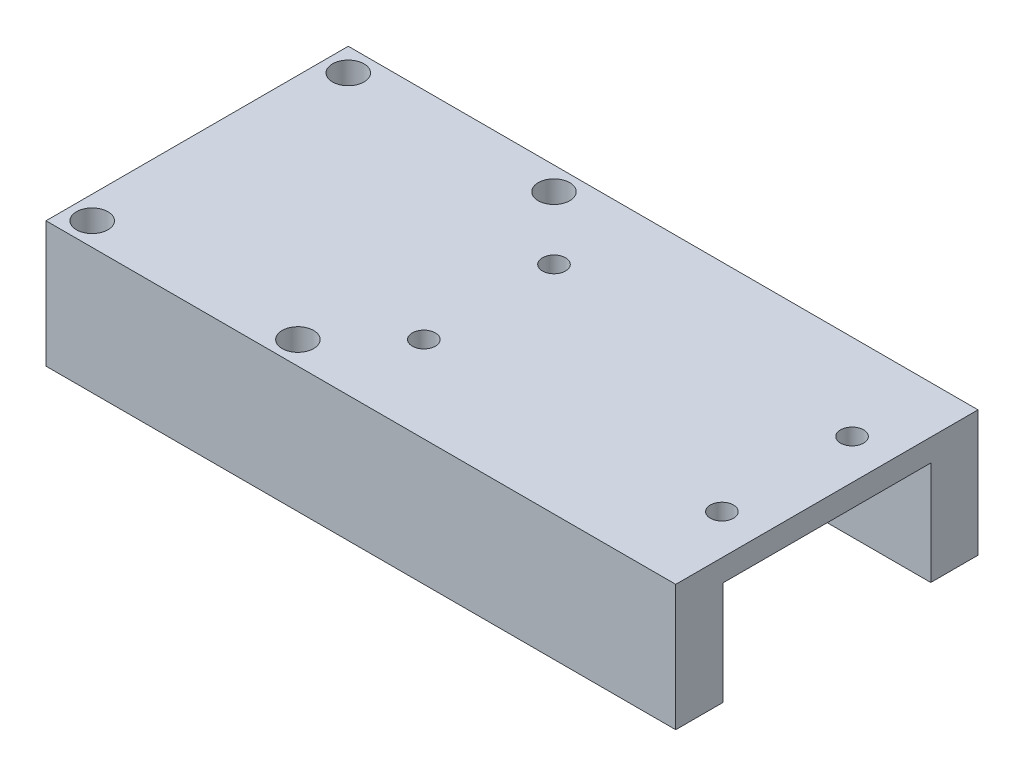
ISO-10303-21;
HEADER;
FILE_DESCRIPTION(('STEP AP214'),'2;1');
FILE_NAME('part.step','',(''),(''),'','','');
FILE_SCHEMA(('AUTOMOTIVE_DESIGN { 1 0 10303 214 1 1 1 1 }'));
ENDSEC;
DATA;
#1=APPLICATION_CONTEXT('core data for automotive mechanical design processes');
#2=APPLICATION_PROTOCOL_DEFINITION('international standard','automotive_design',2000,#1);
#3=PRODUCT_CONTEXT('',#1,'mechanical');
#4=PRODUCT('Part','Part','',(#3));
#5=PRODUCT_RELATED_PRODUCT_CATEGORY('part','',(#4));
#6=PRODUCT_DEFINITION_FORMATION('','',#4);
#7=PRODUCT_DEFINITION_CONTEXT('part definition',#1,'design');
#8=PRODUCT_DEFINITION('design','',#6,#7);
#9=PRODUCT_DEFINITION_SHAPE('','',#8);
#10=(LENGTH_UNIT() NAMED_UNIT(*) SI_UNIT(.MILLI.,.METRE.));
#11=(NAMED_UNIT(*) PLANE_ANGLE_UNIT() SI_UNIT($,.RADIAN.));
#12=(NAMED_UNIT(*) SI_UNIT($,.STERADIAN.) SOLID_ANGLE_UNIT());
#13=UNCERTAINTY_MEASURE_WITH_UNIT(LENGTH_MEASURE(1.E-05),#10,'distance_accuracy_value','');
#14=(GEOMETRIC_REPRESENTATION_CONTEXT(3) GLOBAL_UNCERTAINTY_ASSIGNED_CONTEXT((#13)) GLOBAL_UNIT_ASSIGNED_CONTEXT((#10,
#11,#12)) REPRESENTATION_CONTEXT('',''));
#15=CARTESIAN_POINT('',(0.,0.,0.));
#16=DIRECTION('',(0.,0.,1.));
#17=DIRECTION('',(1.,0.,0.));
#18=AXIS2_PLACEMENT_3D('',#15,#16,#17);
#19=CARTESIAN_POINT('',(15.,30.,18.));
#20=DIRECTION('',(-1.,0.,0.));
#21=DIRECTION('',(0.,0.,1.));
#22=AXIS2_PLACEMENT_3D('',#19,#20,#21);
#23=PLANE('',#22);
#24=DIRECTION('',(0.,-1.,0.));
#25=VECTOR('',#24,1.);
#26=CARTESIAN_POINT('',(15.,27.3313976045781,-12.375));
#27=LINE('',#26,#25);
#28=CARTESIAN_POINT('',(15.,27.3313976045781,-12.375));
#29=VERTEX_POINT('',#28);
#30=CARTESIAN_POINT('',(15.,15.,-12.375));
#31=VERTEX_POINT('',#30);
#32=EDGE_CURVE('E64',#29,#31,#27,.T.);
#33=ORIENTED_EDGE('',*,*,#32,.F.);
#34=DIRECTION('',(0.,0.,-1.));
#35=VECTOR('',#34,1.);
#36=CARTESIAN_POINT('',(15.,27.3313976045781,12.375));
#37=LINE('',#36,#35);
#38=CARTESIAN_POINT('',(15.,27.3313976045781,-1.03791045750838));
#39=VERTEX_POINT('',#38);
#40=EDGE_CURVE('E11',#39,#29,#37,.T.);
#41=ORIENTED_EDGE('',*,*,#40,.F.);
#42=CARTESIAN_POINT('',(15.,15.,0.));
#43=DIRECTION('',(1.,0.,0.));
#44=DIRECTION('',(0.,0.,-1.));
#45=AXIS2_PLACEMENT_3D('',#42,#43,#44);
#46=CIRCLE('',#45,12.375);
#47=EDGE_CURVE('E241',#31,#39,#46,.T.);
#48=ORIENTED_EDGE('',*,*,#47,.F.);
#49=EDGE_LOOP('',(#33,#41,#48));
#50=FACE_BOUND('',#49,.T.);
#51=ADVANCED_FACE('F45',(#50),#23,.F.);
#52=CARTESIAN_POINT('',(15.,27.3313976045781,12.375));
#53=VERTEX_POINT('',#52);
#54=CARTESIAN_POINT('',(15.,27.3313976045781,1.03791045750838));
#55=VERTEX_POINT('',#54);
#56=EDGE_CURVE('E56',#53,#55,#37,.T.);
#57=ORIENTED_EDGE('',*,*,#56,.F.);
#58=DIRECTION('',(0.,1.,0.));
#59=VECTOR('',#58,1.);
#60=CARTESIAN_POINT('',(15.,15.,12.375));
#61=LINE('',#60,#59);
#62=CARTESIAN_POINT('',(15.,15.,12.375));
#63=VERTEX_POINT('',#62);
#64=EDGE_CURVE('E178',#63,#53,#61,.T.);
#65=ORIENTED_EDGE('',*,*,#64,.F.);
#66=EDGE_CURVE('E71',#55,#63,#46,.T.);
#67=ORIENTED_EDGE('',*,*,#66,.F.);
#68=EDGE_LOOP('',(#57,#65,#67));
#69=FACE_BOUND('',#68,.T.);
#70=ADVANCED_FACE('F300',(#69),#23,.F.);
#71=CARTESIAN_POINT('',(-15.,30.,-18.));
#72=DIRECTION('',(0.,0.,1.));
#73=DIRECTION('',(1.,0.,0.));
#74=AXIS2_PLACEMENT_3D('',#71,#72,#73);
#75=PLANE('',#74);
#76=DIRECTION('',(-1.,0.,0.));
#77=VECTOR('',#76,1.);
#78=CARTESIAN_POINT('',(-15.,30.,-18.));
#79=LINE('',#78,#77);
#80=CARTESIAN_POINT('',(60.,30.,-18.));
#81=VERTEX_POINT('',#80);
#82=CARTESIAN_POINT('',(-15.,30.,-18.));
#83=VERTEX_POINT('',#82);
#84=EDGE_CURVE('E247',#81,#83,#79,.T.);
#85=ORIENTED_EDGE('',*,*,#84,.F.);
#86=DIRECTION('',(0.,1.,0.));
#87=VECTOR('',#86,1.);
#88=CARTESIAN_POINT('',(60.,27.3313976045781,-18.));
#89=LINE('',#88,#87);
#90=CARTESIAN_POINT('',(60.,15.,-18.));
#91=VERTEX_POINT('',#90);
#92=EDGE_CURVE('E172',#91,#81,#89,.T.);
#93=ORIENTED_EDGE('',*,*,#92,.F.);
#94=DIRECTION('',(1.,0.,0.));
#95=VECTOR('',#94,1.);
#96=CARTESIAN_POINT('',(-15.,15.,-18.));
#97=LINE('',#96,#95);
#98=CARTESIAN_POINT('',(-15.,15.,-18.));
#99=VERTEX_POINT('',#98);
#100=EDGE_CURVE('E137',#99,#91,#97,.T.);
#101=ORIENTED_EDGE('',*,*,#100,.F.);
#102=DIRECTION('',(0.,-1.,0.));
#103=VECTOR('',#102,1.);
#104=CARTESIAN_POINT('',(-15.,30.,-18.));
#105=LINE('',#104,#103);
#106=EDGE_CURVE('E54',#83,#99,#105,.T.);
#107=ORIENTED_EDGE('',*,*,#106,.F.);
#108=EDGE_LOOP('',(#85,#93,#101,#107));
#109=FACE_BOUND('',#108,.T.);
#110=ADVANCED_FACE('F305',(#109),#75,.F.);
#111=CARTESIAN_POINT('',(-15.,30.,18.));
#112=DIRECTION('',(1.,0.,0.));
#113=DIRECTION('',(0.,0.,-1.));
#114=AXIS2_PLACEMENT_3D('',#111,#112,#113);
#115=PLANE('',#114);
#116=ORIENTED_EDGE('',*,*,#106,.T.);
#117=DIRECTION('',(0.,0.,1.));
#118=VECTOR('',#117,1.);
#119=CARTESIAN_POINT('',(-15.,15.,18.));
#120=LINE('',#119,#118);
#121=CARTESIAN_POINT('',(-15.,15.,-12.375));
#122=VERTEX_POINT('',#121);
#123=EDGE_CURVE('E138',#99,#122,#120,.T.);
#124=ORIENTED_EDGE('',*,*,#123,.T.);
#125=CARTESIAN_POINT('',(-15.,15.,0.));
#126=DIRECTION('',(1.,0.,0.));
#127=DIRECTION('',(0.,0.,-1.));
#128=AXIS2_PLACEMENT_3D('',#125,#126,#127);
#129=CIRCLE('',#128,12.375);
#130=CARTESIAN_POINT('',(-15.,15.,12.375));
#131=VERTEX_POINT('',#130);
#132=EDGE_CURVE('E245',#122,#131,#129,.T.);
#133=ORIENTED_EDGE('',*,*,#132,.T.);
#134=CARTESIAN_POINT('',(-15.,15.,18.));
#135=VERTEX_POINT('',#134);
#136=EDGE_CURVE('E199',#131,#135,#120,.T.);
#137=ORIENTED_EDGE('',*,*,#136,.T.);
#138=DIRECTION('',(0.,-1.,0.));
#139=VECTOR('',#138,1.);
#140=CARTESIAN_POINT('',(-15.,30.,18.));
#141=LINE('',#140,#139);
#142=CARTESIAN_POINT('',(-15.,30.,18.));
#143=VERTEX_POINT('',#142);
#144=EDGE_CURVE('E132',#143,#135,#141,.T.);
#145=ORIENTED_EDGE('',*,*,#144,.F.);
#146=DIRECTION('',(0.,0.,1.));
#147=VECTOR('',#146,1.);
#148=CARTESIAN_POINT('',(-15.,30.,18.));
#149=LINE('',#148,#147);
#150=EDGE_CURVE('E250',#83,#143,#149,.T.);
#151=ORIENTED_EDGE('',*,*,#150,.F.);
#152=EDGE_LOOP('',(#116,#124,#133,#137,#145,#151));
#153=FACE_BOUND('',#152,.T.);
#154=ADVANCED_FACE('F309',(#153),#115,.F.);
#155=CARTESIAN_POINT('',(-15.,30.,18.));
#156=DIRECTION('',(0.,0.,-1.));
#157=DIRECTION('',(-1.,0.,0.));
#158=AXIS2_PLACEMENT_3D('',#155,#156,#157);
#159=PLANE('',#158);
#160=ORIENTED_EDGE('',*,*,#144,.T.);
#161=DIRECTION('',(1.,0.,0.));
#162=VECTOR('',#161,1.);
#163=CARTESIAN_POINT('',(-15.,15.,18.));
#164=LINE('',#163,#162);
#165=CARTESIAN_POINT('',(60.,15.,18.));
#166=VERTEX_POINT('',#165);
#167=EDGE_CURVE('E126',#135,#166,#164,.T.);
#168=ORIENTED_EDGE('',*,*,#167,.T.);
#169=DIRECTION('',(0.,-1.,0.));
#170=VECTOR('',#169,1.);
#171=CARTESIAN_POINT('',(60.,30.,18.));
#172=LINE('',#171,#170);
#173=CARTESIAN_POINT('',(60.,30.,18.));
#174=VERTEX_POINT('',#173);
#175=EDGE_CURVE('E130',#174,#166,#172,.T.);
#176=ORIENTED_EDGE('',*,*,#175,.F.);
#177=DIRECTION('',(1.,0.,0.));
#178=VECTOR('',#177,1.);
#179=CARTESIAN_POINT('',(-15.,30.,18.));
#180=LINE('',#179,#178);
#181=EDGE_CURVE('E253',#143,#174,#180,.T.);
#182=ORIENTED_EDGE('',*,*,#181,.F.);
#183=EDGE_LOOP('',(#160,#168,#176,#182));
#184=FACE_BOUND('',#183,.T.);
#185=ADVANCED_FACE('F128',(#184),#159,.F.);
#186=CARTESIAN_POINT('',(0.,30.,0.));
#187=DIRECTION('',(0.,-1.,0.));
#188=DIRECTION('',(0.,0.,-1.));
#189=AXIS2_PLACEMENT_3D('',#186,#187,#188);
#190=PLANE('',#189);
#191=CARTESIAN_POINT('',(55.25,30.,-7.74999999999999));
#192=DIRECTION('',(0.,1.,0.));
#193=DIRECTION('',(0.,0.,-1.));
#194=AXIS2_PLACEMENT_3D('',#191,#192,#193);
#195=CIRCLE('',#194,1.375);
#196=CARTESIAN_POINT('',(55.25,30.,-9.12499999999999));
#197=VERTEX_POINT('',#196);
#198=EDGE_CURVE('E542',#197,#197,#195,.T.);
#199=ORIENTED_EDGE('',*,*,#198,.F.);
#200=EDGE_LOOP('',(#199));
#201=FACE_BOUND('',#200,.T.);
#202=CARTESIAN_POINT('',(55.25,30.,7.74999999999999));
#203=DIRECTION('',(0.,1.,0.));
#204=DIRECTION('',(0.,0.,1.));
#205=AXIS2_PLACEMENT_3D('',#202,#203,#204);
#206=CIRCLE('',#205,1.375);
#207=CARTESIAN_POINT('',(55.25,30.,9.125));
#208=VERTEX_POINT('',#207);
#209=EDGE_CURVE('E536',#208,#208,#206,.T.);
#210=ORIENTED_EDGE('',*,*,#209,.F.);
#211=EDGE_LOOP('',(#210));
#212=FACE_BOUND('',#211,.T.);
#213=CARTESIAN_POINT('',(19.75,30.,7.75));
#214=DIRECTION('',(0.,1.,0.));
#215=DIRECTION('',(0.,0.,-1.));
#216=AXIS2_PLACEMENT_3D('',#213,#214,#215);
#217=CIRCLE('',#216,1.375);
#218=CARTESIAN_POINT('',(19.75,30.,6.375));
#219=VERTEX_POINT('',#218);
#220=EDGE_CURVE('E519',#219,#219,#217,.T.);
#221=ORIENTED_EDGE('',*,*,#220,.F.);
#222=EDGE_LOOP('',(#221));
#223=FACE_BOUND('',#222,.T.);
#224=CARTESIAN_POINT('',(19.75,30.,-7.75));
#225=DIRECTION('',(0.,1.,0.));
#226=DIRECTION('',(0.,0.,1.));
#227=AXIS2_PLACEMENT_3D('',#224,#225,#226);
#228=CIRCLE('',#227,1.375);
#229=CARTESIAN_POINT('',(19.75,30.,-6.375));
#230=VERTEX_POINT('',#229);
#231=EDGE_CURVE('E272',#230,#230,#228,.T.);
#232=ORIENTED_EDGE('',*,*,#231,.F.);
#233=EDGE_LOOP('',(#232));
#234=FACE_BOUND('',#233,.T.);
#235=CARTESIAN_POINT('',(12.25,30.,-15.25));
#236=DIRECTION('',(0.,1.,0.));
#237=DIRECTION('',(0.,0.,-1.));
#238=AXIS2_PLACEMENT_3D('',#235,#236,#237);
#239=CIRCLE('',#238,1.875);
#240=CARTESIAN_POINT('',(12.25,30.,-17.125));
#241=VERTEX_POINT('',#240);
#242=EDGE_CURVE('E225',#241,#241,#239,.T.);
#243=ORIENTED_EDGE('',*,*,#242,.F.);
#244=EDGE_LOOP('',(#243));
#245=FACE_BOUND('',#244,.T.);
#246=CARTESIAN_POINT('',(12.25,30.,15.25));
#247=DIRECTION('',(0.,1.,0.));
#248=DIRECTION('',(0.,0.,1.));
#249=AXIS2_PLACEMENT_3D('',#246,#247,#248);
#250=CIRCLE('',#249,1.875);
#251=CARTESIAN_POINT('',(12.25,30.,17.125));
#252=VERTEX_POINT('',#251);
#253=EDGE_CURVE('E231',#252,#252,#250,.T.);
#254=ORIENTED_EDGE('',*,*,#253,.F.);
#255=EDGE_LOOP('',(#254));
#256=FACE_BOUND('',#255,.T.);
#257=CARTESIAN_POINT('',(-12.25,30.,15.25));
#258=DIRECTION('',(0.,1.,0.));
#259=DIRECTION('',(0.,0.,-1.));
#260=AXIS2_PLACEMENT_3D('',#257,#258,#259);
#261=CIRCLE('',#260,1.875);
#262=CARTESIAN_POINT('',(-12.25,30.,13.375));
#263=VERTEX_POINT('',#262);
#264=EDGE_CURVE('E226',#263,#263,#261,.T.);
#265=ORIENTED_EDGE('',*,*,#264,.F.);
#266=EDGE_LOOP('',(#265));
#267=FACE_BOUND('',#266,.T.);
#268=CARTESIAN_POINT('',(-12.25,30.,-15.25));
#269=DIRECTION('',(0.,1.,0.));
#270=DIRECTION('',(0.,0.,1.));
#271=AXIS2_PLACEMENT_3D('',#268,#269,#270);
#272=CIRCLE('',#271,1.875);
#273=CARTESIAN_POINT('',(-12.25,30.,-13.375));
#274=VERTEX_POINT('',#273);
#275=EDGE_CURVE('E230',#274,#274,#272,.T.);
#276=ORIENTED_EDGE('',*,*,#275,.F.);
#277=EDGE_LOOP('',(#276));
#278=FACE_BOUND('',#277,.T.);
#279=ORIENTED_EDGE('',*,*,#181,.T.);
#280=DIRECTION('',(0.,0.,1.));
#281=VECTOR('',#280,1.);
#282=CARTESIAN_POINT('',(60.,30.,18.));
#283=LINE('',#282,#281);
#284=EDGE_CURVE('E147',#81,#174,#283,.T.);
#285=ORIENTED_EDGE('',*,*,#284,.F.);
#286=ORIENTED_EDGE('',*,*,#84,.T.);
#287=ORIENTED_EDGE('',*,*,#150,.T.);
#288=EDGE_LOOP('',(#279,#285,#286,#287));
#289=FACE_BOUND('',#288,.T.);
#290=ADVANCED_FACE('F332',(#201,#212,#223,#234,#245,#256,#267,#278,#289),#190,.F.);
#291=CARTESIAN_POINT('',(-25.,15.,0.));
#292=DIRECTION('',(1.,0.,0.));
#293=DIRECTION('',(0.,0.,-1.));
#294=AXIS2_PLACEMENT_3D('',#291,#292,#293);
#295=CYLINDRICAL_SURFACE('',#294,12.375);
#296=ORIENTED_EDGE('',*,*,#47,.T.);
#297=EDGE_CURVE('E246',#39,#55,#46,.T.);
#298=ORIENTED_EDGE('',*,*,#297,.T.);
#299=ORIENTED_EDGE('',*,*,#66,.T.);
#300=DIRECTION('',(1.,0.,0.));
#301=VECTOR('',#300,1.);
#302=CARTESIAN_POINT('',(-25.,15.,12.375));
#303=LINE('',#302,#301);
#304=EDGE_CURVE('E221',#63,#131,#303,.F.);
#305=ORIENTED_EDGE('',*,*,#304,.T.);
#306=ORIENTED_EDGE('',*,*,#132,.F.);
#307=DIRECTION('',(1.,0.,0.));
#308=VECTOR('',#307,1.);
#309=CARTESIAN_POINT('',(-25.,15.,-12.375));
#310=LINE('',#309,#308);
#311=EDGE_CURVE('E218',#122,#31,#310,.T.);
#312=ORIENTED_EDGE('',*,*,#311,.T.);
#313=EDGE_LOOP('',(#296,#298,#299,#305,#306,#312));
#314=FACE_BOUND('',#313,.T.);
#315=ADVANCED_FACE('F334',(#314),#295,.F.);
#316=CARTESIAN_POINT('',(-12.25,-10.,-15.25));
#317=DIRECTION('',(0.,1.,0.));
#318=DIRECTION('',(0.,0.,1.));
#319=AXIS2_PLACEMENT_3D('',#316,#317,#318);
#320=CYLINDRICAL_SURFACE('',#319,1.875);
#321=CARTESIAN_POINT('',(-12.25,15.,-15.25));
#322=DIRECTION('',(0.,1.,0.));
#323=DIRECTION('',(0.,0.,1.));
#324=AXIS2_PLACEMENT_3D('',#321,#322,#323);
#325=CIRCLE('',#324,1.875);
#326=CARTESIAN_POINT('',(-12.25,15.,-13.375));
#327=VERTEX_POINT('',#326);
#328=EDGE_CURVE('E214',#327,#327,#325,.F.);
#329=ORIENTED_EDGE('',*,*,#328,.T.);
#330=EDGE_LOOP('',(#329));
#331=FACE_BOUND('',#330,.T.);
#332=ORIENTED_EDGE('',*,*,#275,.T.);
#333=EDGE_LOOP('',(#332));
#334=FACE_BOUND('',#333,.T.);
#335=ADVANCED_FACE('F342',(#331,#334),#320,.F.);
#336=CARTESIAN_POINT('',(-12.25,-10.,15.25));
#337=DIRECTION('',(0.,1.,0.));
#338=DIRECTION('',(0.,0.,1.));
#339=AXIS2_PLACEMENT_3D('',#336,#337,#338);
#340=CYLINDRICAL_SURFACE('',#339,1.875);
#341=CARTESIAN_POINT('',(-12.25,15.,15.25));
#342=DIRECTION('',(0.,1.,0.));
#343=DIRECTION('',(0.,0.,1.));
#344=AXIS2_PLACEMENT_3D('',#341,#342,#343);
#345=CIRCLE('',#344,1.875);
#346=CARTESIAN_POINT('',(-12.25,15.,17.125));
#347=VERTEX_POINT('',#346);
#348=EDGE_CURVE('E210',#347,#347,#345,.F.);
#349=ORIENTED_EDGE('',*,*,#348,.T.);
#350=EDGE_LOOP('',(#349));
#351=FACE_BOUND('',#350,.T.);
#352=ORIENTED_EDGE('',*,*,#264,.T.);
#353=EDGE_LOOP('',(#352));
#354=FACE_BOUND('',#353,.T.);
#355=ADVANCED_FACE('F363',(#351,#354),#340,.F.);
#356=CARTESIAN_POINT('',(12.25,-10.,15.25));
#357=DIRECTION('',(0.,1.,0.));
#358=DIRECTION('',(0.,0.,1.));
#359=AXIS2_PLACEMENT_3D('',#356,#357,#358);
#360=CYLINDRICAL_SURFACE('',#359,1.875);
#361=CARTESIAN_POINT('',(12.25,15.,15.25));
#362=DIRECTION('',(0.,1.,0.));
#363=DIRECTION('',(0.,0.,1.));
#364=AXIS2_PLACEMENT_3D('',#361,#362,#363);
#365=CIRCLE('',#364,1.875);
#366=CARTESIAN_POINT('',(12.25,15.,17.125));
#367=VERTEX_POINT('',#366);
#368=EDGE_CURVE('E206',#367,#367,#365,.F.);
#369=ORIENTED_EDGE('',*,*,#368,.T.);
#370=EDGE_LOOP('',(#369));
#371=FACE_BOUND('',#370,.T.);
#372=ORIENTED_EDGE('',*,*,#253,.T.);
#373=EDGE_LOOP('',(#372));
#374=FACE_BOUND('',#373,.T.);
#375=ADVANCED_FACE('F372',(#371,#374),#360,.F.);
#376=CARTESIAN_POINT('',(12.25,-10.,-15.25));
#377=DIRECTION('',(0.,1.,0.));
#378=DIRECTION('',(0.,0.,1.));
#379=AXIS2_PLACEMENT_3D('',#376,#377,#378);
#380=CYLINDRICAL_SURFACE('',#379,1.875);
#381=CARTESIAN_POINT('',(12.25,15.,-15.25));
#382=DIRECTION('',(0.,1.,0.));
#383=DIRECTION('',(0.,0.,1.));
#384=AXIS2_PLACEMENT_3D('',#381,#382,#383);
#385=CIRCLE('',#384,1.875);
#386=CARTESIAN_POINT('',(12.25,15.,-13.375));
#387=VERTEX_POINT('',#386);
#388=EDGE_CURVE('E204',#387,#387,#385,.F.);
#389=ORIENTED_EDGE('',*,*,#388,.T.);
#390=EDGE_LOOP('',(#389));
#391=FACE_BOUND('',#390,.T.);
#392=ORIENTED_EDGE('',*,*,#242,.T.);
#393=EDGE_LOOP('',(#392));
#394=FACE_BOUND('',#393,.T.);
#395=ADVANCED_FACE('F380',(#391,#394),#380,.F.);
#396=CARTESIAN_POINT('',(-15.,15.,18.));
#397=DIRECTION('',(0.,1.,0.));
#398=DIRECTION('',(0.,0.,1.));
#399=AXIS2_PLACEMENT_3D('',#396,#397,#398);
#400=PLANE('',#399);
#401=ORIENTED_EDGE('',*,*,#328,.F.);
#402=EDGE_LOOP('',(#401));
#403=FACE_BOUND('',#402,.T.);
#404=ORIENTED_EDGE('',*,*,#388,.F.);
#405=EDGE_LOOP('',(#404));
#406=FACE_BOUND('',#405,.T.);
#407=ORIENTED_EDGE('',*,*,#123,.F.);
#408=ORIENTED_EDGE('',*,*,#100,.T.);
#409=DIRECTION('',(0.,0.,-1.));
#410=VECTOR('',#409,1.);
#411=CARTESIAN_POINT('',(60.,15.,-18.));
#412=LINE('',#411,#410);
#413=CARTESIAN_POINT('',(60.,15.,-12.375));
#414=VERTEX_POINT('',#413);
#415=EDGE_CURVE('E168',#414,#91,#412,.T.);
#416=ORIENTED_EDGE('',*,*,#415,.F.);
#417=DIRECTION('',(-1.,0.,0.));
#418=VECTOR('',#417,1.);
#419=CARTESIAN_POINT('',(60.,15.,-12.375));
#420=LINE('',#419,#418);
#421=EDGE_CURVE('E177',#414,#31,#420,.T.);
#422=ORIENTED_EDGE('',*,*,#421,.T.);
#423=ORIENTED_EDGE('',*,*,#311,.F.);
#424=EDGE_LOOP('',(#407,#408,#416,#422,#423));
#425=FACE_BOUND('',#424,.T.);
#426=ADVANCED_FACE('F325',(#403,#406,#425),#400,.F.);
#427=ORIENTED_EDGE('',*,*,#348,.F.);
#428=EDGE_LOOP('',(#427));
#429=FACE_BOUND('',#428,.T.);
#430=ORIENTED_EDGE('',*,*,#368,.F.);
#431=EDGE_LOOP('',(#430));
#432=FACE_BOUND('',#431,.T.);
#433=ORIENTED_EDGE('',*,*,#304,.F.);
#434=DIRECTION('',(-1.,0.,0.));
#435=VECTOR('',#434,1.);
#436=CARTESIAN_POINT('',(60.,15.,12.375));
#437=LINE('',#436,#435);
#438=CARTESIAN_POINT('',(60.,15.,12.375));
#439=VERTEX_POINT('',#438);
#440=EDGE_CURVE('E153',#439,#63,#437,.T.);
#441=ORIENTED_EDGE('',*,*,#440,.F.);
#442=DIRECTION('',(0.,0.,-1.));
#443=VECTOR('',#442,1.);
#444=CARTESIAN_POINT('',(60.,15.,18.));
#445=LINE('',#444,#443);
#446=EDGE_CURVE('E143',#166,#439,#445,.T.);
#447=ORIENTED_EDGE('',*,*,#446,.F.);
#448=ORIENTED_EDGE('',*,*,#167,.F.);
#449=ORIENTED_EDGE('',*,*,#136,.F.);
#450=EDGE_LOOP('',(#433,#441,#447,#448,#449));
#451=FACE_BOUND('',#450,.T.);
#452=ADVANCED_FACE('F151',(#429,#432,#451),#400,.F.);
#453=CARTESIAN_POINT('',(60.,15.,12.375));
#454=DIRECTION('',(0.,0.,1.));
#455=DIRECTION('',(1.,0.,0.));
#456=AXIS2_PLACEMENT_3D('',#453,#454,#455);
#457=PLANE('',#456);
#458=ORIENTED_EDGE('',*,*,#64,.T.);
#459=DIRECTION('',(-1.,0.,0.));
#460=VECTOR('',#459,1.);
#461=CARTESIAN_POINT('',(60.,27.3313976045781,12.375));
#462=LINE('',#461,#460);
#463=CARTESIAN_POINT('',(60.,27.3313976045781,12.375));
#464=VERTEX_POINT('',#463);
#465=EDGE_CURVE('E193',#464,#53,#462,.T.);
#466=ORIENTED_EDGE('',*,*,#465,.F.);
#467=DIRECTION('',(0.,1.,0.));
#468=VECTOR('',#467,1.);
#469=CARTESIAN_POINT('',(60.,15.,12.375));
#470=LINE('',#469,#468);
#471=EDGE_CURVE('E156',#439,#464,#470,.T.);
#472=ORIENTED_EDGE('',*,*,#471,.F.);
#473=ORIENTED_EDGE('',*,*,#440,.T.);
#474=EDGE_LOOP('',(#458,#466,#472,#473));
#475=FACE_BOUND('',#474,.T.);
#476=ADVANCED_FACE('F315',(#475),#457,.F.);
#477=CARTESIAN_POINT('',(60.,27.3313976045781,12.375));
#478=DIRECTION('',(0.,1.,0.));
#479=DIRECTION('',(0.,0.,1.));
#480=AXIS2_PLACEMENT_3D('',#477,#478,#479);
#481=PLANE('',#480);
#482=CARTESIAN_POINT('',(55.25,27.3313976045781,-7.74999999999999));
#483=DIRECTION('',(0.,1.,0.));
#484=DIRECTION('',(0.,0.,1.));
#485=AXIS2_PLACEMENT_3D('',#482,#483,#484);
#486=CIRCLE('',#485,1.375);
#487=CARTESIAN_POINT('',(55.25,27.3313976045781,-6.375));
#488=VERTEX_POINT('',#487);
#489=EDGE_CURVE('E48',#488,#488,#486,.T.);
#490=ORIENTED_EDGE('',*,*,#489,.T.);
#491=EDGE_LOOP('',(#490));
#492=FACE_BOUND('',#491,.T.);
#493=CARTESIAN_POINT('',(55.25,27.3313976045781,7.74999999999999));
#494=DIRECTION('',(0.,1.,0.));
#495=DIRECTION('',(0.,0.,1.));
#496=AXIS2_PLACEMENT_3D('',#493,#494,#495);
#497=CIRCLE('',#496,1.375);
#498=CARTESIAN_POINT('',(55.25,27.3313976045781,9.125));
#499=VERTEX_POINT('',#498);
#500=EDGE_CURVE('E275',#499,#499,#497,.T.);
#501=ORIENTED_EDGE('',*,*,#500,.T.);
#502=EDGE_LOOP('',(#501));
#503=FACE_BOUND('',#502,.T.);
#504=CARTESIAN_POINT('',(19.75,27.3313976045781,7.75));
#505=DIRECTION('',(0.,1.,0.));
#506=DIRECTION('',(0.,0.,1.));
#507=AXIS2_PLACEMENT_3D('',#504,#505,#506);
#508=CIRCLE('',#507,1.375);
#509=CARTESIAN_POINT('',(19.75,27.3313976045781,9.125));
#510=VERTEX_POINT('',#509);
#511=EDGE_CURVE('E271',#510,#510,#508,.T.);
#512=ORIENTED_EDGE('',*,*,#511,.T.);
#513=EDGE_LOOP('',(#512));
#514=FACE_BOUND('',#513,.T.);
#515=CARTESIAN_POINT('',(19.75,27.3313976045781,-7.75));
#516=DIRECTION('',(0.,1.,0.));
#517=DIRECTION('',(0.,0.,1.));
#518=AXIS2_PLACEMENT_3D('',#515,#516,#517);
#519=CIRCLE('',#518,1.375);
#520=CARTESIAN_POINT('',(19.75,27.3313976045781,-6.375));
#521=VERTEX_POINT('',#520);
#522=EDGE_CURVE('E267',#521,#521,#519,.T.);
#523=ORIENTED_EDGE('',*,*,#522,.T.);
#524=EDGE_LOOP('',(#523));
#525=FACE_BOUND('',#524,.T.);
#526=ORIENTED_EDGE('',*,*,#56,.T.);
#527=EDGE_CURVE('E57',#55,#39,#37,.T.);
#528=ORIENTED_EDGE('',*,*,#527,.T.);
#529=ORIENTED_EDGE('',*,*,#40,.T.);
#530=DIRECTION('',(-1.,0.,0.));
#531=VECTOR('',#530,1.);
#532=CARTESIAN_POINT('',(60.,27.3313976045781,-12.375));
#533=LINE('',#532,#531);
#534=CARTESIAN_POINT('',(60.,27.3313976045781,-12.375));
#535=VERTEX_POINT('',#534);
#536=EDGE_CURVE('E189',#535,#29,#533,.T.);
#537=ORIENTED_EDGE('',*,*,#536,.F.);
#538=DIRECTION('',(0.,0.,-1.));
#539=VECTOR('',#538,1.);
#540=CARTESIAN_POINT('',(60.,27.3313976045781,12.375));
#541=LINE('',#540,#539);
#542=EDGE_CURVE('E159',#464,#535,#541,.T.);
#543=ORIENTED_EDGE('',*,*,#542,.F.);
#544=ORIENTED_EDGE('',*,*,#465,.T.);
#545=EDGE_LOOP('',(#526,#528,#529,#537,#543,#544));
#546=FACE_BOUND('',#545,.T.);
#547=ADVANCED_FACE('F284',(#492,#503,#514,#525,#546),#481,.F.);
#548=CARTESIAN_POINT('',(60.,27.3313976045781,-12.375));
#549=DIRECTION('',(0.,0.,-1.));
#550=DIRECTION('',(-1.,0.,0.));
#551=AXIS2_PLACEMENT_3D('',#548,#549,#550);
#552=PLANE('',#551);
#553=ORIENTED_EDGE('',*,*,#32,.T.);
#554=ORIENTED_EDGE('',*,*,#421,.F.);
#555=DIRECTION('',(0.,-1.,0.));
#556=VECTOR('',#555,1.);
#557=CARTESIAN_POINT('',(60.,27.3313976045781,-12.375));
#558=LINE('',#557,#556);
#559=EDGE_CURVE('E165',#535,#414,#558,.T.);
#560=ORIENTED_EDGE('',*,*,#559,.F.);
#561=ORIENTED_EDGE('',*,*,#536,.T.);
#562=EDGE_LOOP('',(#553,#554,#560,#561));
#563=FACE_BOUND('',#562,.T.);
#564=ADVANCED_FACE('F323',(#563),#552,.F.);
#565=CARTESIAN_POINT('',(60.,0.,0.));
#566=DIRECTION('',(1.,0.,0.));
#567=DIRECTION('',(0.,0.,-1.));
#568=AXIS2_PLACEMENT_3D('',#565,#566,#567);
#569=PLANE('',#568);
#570=ORIENTED_EDGE('',*,*,#175,.T.);
#571=ORIENTED_EDGE('',*,*,#446,.T.);
#572=ORIENTED_EDGE('',*,*,#471,.T.);
#573=ORIENTED_EDGE('',*,*,#542,.T.);
#574=ORIENTED_EDGE('',*,*,#559,.T.);
#575=ORIENTED_EDGE('',*,*,#415,.T.);
#576=ORIENTED_EDGE('',*,*,#92,.T.);
#577=ORIENTED_EDGE('',*,*,#284,.T.);
#578=EDGE_LOOP('',(#570,#571,#572,#573,#574,#575,#576,#577));
#579=FACE_BOUND('',#578,.T.);
#580=ADVANCED_FACE('F142',(#579),#569,.T.);
#581=CARTESIAN_POINT('',(15.,0.,0.));
#582=DIRECTION('',(1.,0.,0.));
#583=DIRECTION('',(0.,0.,-1.));
#584=AXIS2_PLACEMENT_3D('',#581,#582,#583);
#585=PLANE('',#584);
#586=ORIENTED_EDGE('',*,*,#297,.F.);
#587=ORIENTED_EDGE('',*,*,#527,.F.);
#588=EDGE_LOOP('',(#586,#587));
#589=FACE_BOUND('',#588,.T.);
#590=ADVANCED_FACE('F475',(#589),#585,.F.);
#591=CARTESIAN_POINT('',(19.75,20.,-7.75));
#592=DIRECTION('',(0.,1.,0.));
#593=DIRECTION('',(0.,0.,1.));
#594=AXIS2_PLACEMENT_3D('',#591,#592,#593);
#595=CYLINDRICAL_SURFACE('',#594,1.375);
#596=ORIENTED_EDGE('',*,*,#231,.T.);
#597=EDGE_LOOP('',(#596));
#598=FACE_BOUND('',#597,.T.);
#599=ORIENTED_EDGE('',*,*,#522,.F.);
#600=EDGE_LOOP('',(#599));
#601=FACE_BOUND('',#600,.T.);
#602=ADVANCED_FACE('F482',(#598,#601),#595,.F.);
#603=CARTESIAN_POINT('',(19.75,20.,7.75));
#604=DIRECTION('',(0.,1.,0.));
#605=DIRECTION('',(0.,0.,1.));
#606=AXIS2_PLACEMENT_3D('',#603,#604,#605);
#607=CYLINDRICAL_SURFACE('',#606,1.375);
#608=ORIENTED_EDGE('',*,*,#220,.T.);
#609=EDGE_LOOP('',(#608));
#610=FACE_BOUND('',#609,.T.);
#611=ORIENTED_EDGE('',*,*,#511,.F.);
#612=EDGE_LOOP('',(#611));
#613=FACE_BOUND('',#612,.T.);
#614=ADVANCED_FACE('F294',(#610,#613),#607,.F.);
#615=CARTESIAN_POINT('',(55.25,20.,7.74999999999999));
#616=DIRECTION('',(0.,1.,0.));
#617=DIRECTION('',(0.,0.,1.));
#618=AXIS2_PLACEMENT_3D('',#615,#616,#617);
#619=CYLINDRICAL_SURFACE('',#618,1.375);
#620=ORIENTED_EDGE('',*,*,#209,.T.);
#621=EDGE_LOOP('',(#620));
#622=FACE_BOUND('',#621,.T.);
#623=ORIENTED_EDGE('',*,*,#500,.F.);
#624=EDGE_LOOP('',(#623));
#625=FACE_BOUND('',#624,.T.);
#626=ADVANCED_FACE('F288',(#622,#625),#619,.F.);
#627=CARTESIAN_POINT('',(55.25,20.,-7.74999999999999));
#628=DIRECTION('',(0.,1.,0.));
#629=DIRECTION('',(0.,0.,1.));
#630=AXIS2_PLACEMENT_3D('',#627,#628,#629);
#631=CYLINDRICAL_SURFACE('',#630,1.375);
#632=ORIENTED_EDGE('',*,*,#198,.T.);
#633=EDGE_LOOP('',(#632));
#634=FACE_BOUND('',#633,.T.);
#635=ORIENTED_EDGE('',*,*,#489,.F.);
#636=EDGE_LOOP('',(#635));
#637=FACE_BOUND('',#636,.T.);
#638=ADVANCED_FACE('F286',(#634,#637),#631,.F.);
#639=CLOSED_SHELL('',(#51,#70,#110,#154,#185,#290,#315,#335,#355,#375,#395,#426,#452,#476,#547,
#564,#580,#590,#602,#614,#626,#638));
#640=MANIFOLD_SOLID_BREP('B2',#639);
#641=ADVANCED_BREP_SHAPE_REPRESENTATION('',(#18,#640),#14);
#642=SHAPE_DEFINITION_REPRESENTATION(#9,#641);
ENDSEC;
END-ISO-10303-21;
